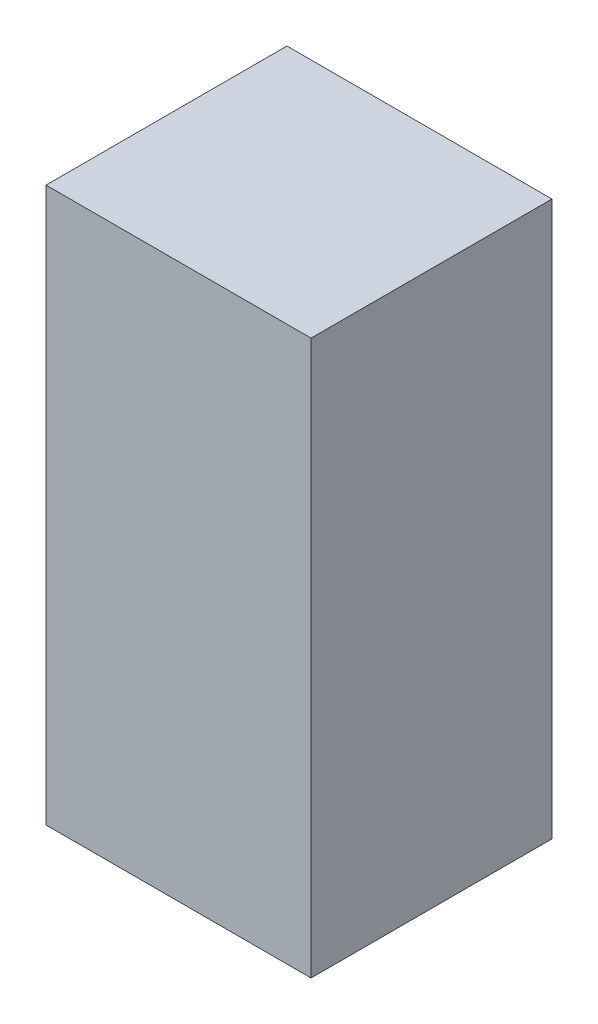
ISO-10303-21;
HEADER;
FILE_DESCRIPTION(('STEP AP214'),'2;1');
FILE_NAME('part.step','',(''),(''),'','','');
FILE_SCHEMA(('AUTOMOTIVE_DESIGN { 1 0 10303 214 1 1 1 1 }'));
ENDSEC;
DATA;
#1=APPLICATION_CONTEXT('core data for automotive mechanical design processes');
#2=APPLICATION_PROTOCOL_DEFINITION('international standard','automotive_design',2000,#1);
#3=PRODUCT_CONTEXT('',#1,'mechanical');
#4=PRODUCT('Part','Part','',(#3));
#5=PRODUCT_RELATED_PRODUCT_CATEGORY('part','',(#4));
#6=PRODUCT_DEFINITION_FORMATION('','',#4);
#7=PRODUCT_DEFINITION_CONTEXT('part definition',#1,'design');
#8=PRODUCT_DEFINITION('design','',#6,#7);
#9=PRODUCT_DEFINITION_SHAPE('','',#8);
#10=(LENGTH_UNIT() NAMED_UNIT(*) SI_UNIT(.MILLI.,.METRE.));
#11=(NAMED_UNIT(*) PLANE_ANGLE_UNIT() SI_UNIT($,.RADIAN.));
#12=(NAMED_UNIT(*) SI_UNIT($,.STERADIAN.) SOLID_ANGLE_UNIT());
#13=UNCERTAINTY_MEASURE_WITH_UNIT(LENGTH_MEASURE(1.E-05),#10,'distance_accuracy_value','');
#14=(GEOMETRIC_REPRESENTATION_CONTEXT(3) GLOBAL_UNCERTAINTY_ASSIGNED_CONTEXT((#13)) GLOBAL_UNIT_ASSIGNED_CONTEXT((#10,
#11,#12)) REPRESENTATION_CONTEXT('',''));
#15=CARTESIAN_POINT('',(0.,0.,0.));
#16=DIRECTION('',(0.,0.,1.));
#17=DIRECTION('',(1.,0.,0.));
#18=AXIS2_PLACEMENT_3D('',#15,#16,#17);
#19=CARTESIAN_POINT('',(-0.27499818,-0.57499758,0.499999));
#20=DIRECTION('',(0.,0.,-1.));
#21=DIRECTION('',(-1.,0.,0.));
#22=AXIS2_PLACEMENT_3D('',#19,#20,#21);
#23=PLANE('',#22);
#24=DIRECTION('',(0.,1.,0.));
#25=VECTOR('',#24,1.);
#26=CARTESIAN_POINT('',(0.27500072,-0.57499758,0.499999));
#27=LINE('',#26,#25);
#28=CARTESIAN_POINT('',(0.27500072,-0.57499758,0.499999));
#29=VERTEX_POINT('',#28);
#30=CARTESIAN_POINT('',(0.27500072,0.57500012,0.499999));
#31=VERTEX_POINT('',#30);
#32=EDGE_CURVE('E55',#29,#31,#27,.T.);
#33=ORIENTED_EDGE('',*,*,#32,.T.);
#34=DIRECTION('',(1.,0.,0.));
#35=VECTOR('',#34,1.);
#36=CARTESIAN_POINT('',(0.27500072,0.57500012,0.499999));
#37=LINE('',#36,#35);
#38=CARTESIAN_POINT('',(-0.27499818,0.57500012,0.499999));
#39=VERTEX_POINT('',#38);
#40=EDGE_CURVE('E57',#31,#39,#37,.F.);
#41=ORIENTED_EDGE('',*,*,#40,.T.);
#42=DIRECTION('',(0.,1.,0.));
#43=VECTOR('',#42,1.);
#44=CARTESIAN_POINT('',(-0.27499818,0.57500012,0.499999));
#45=LINE('',#44,#43);
#46=CARTESIAN_POINT('',(-0.27499818,-0.57499758,0.499999));
#47=VERTEX_POINT('',#46);
#48=EDGE_CURVE('E20',#39,#47,#45,.F.);
#49=ORIENTED_EDGE('',*,*,#48,.T.);
#50=DIRECTION('',(1.,0.,0.));
#51=VECTOR('',#50,1.);
#52=CARTESIAN_POINT('',(-0.27499818,-0.57499758,0.499999));
#53=LINE('',#52,#51);
#54=EDGE_CURVE('E80',#47,#29,#53,.T.);
#55=ORIENTED_EDGE('',*,*,#54,.T.);
#56=EDGE_LOOP('',(#33,#41,#49,#55));
#57=FACE_BOUND('',#56,.T.);
#58=ADVANCED_FACE('F17',(#57),#23,.F.);
#59=CARTESIAN_POINT('',(-0.27499818,0.57500012,0.));
#60=DIRECTION('',(1.,0.,0.));
#61=DIRECTION('',(0.,0.,-1.));
#62=AXIS2_PLACEMENT_3D('',#59,#60,#61);
#63=PLANE('',#62);
#64=DIRECTION('',(0.,0.,1.));
#65=VECTOR('',#64,1.);
#66=CARTESIAN_POINT('',(-0.27499818,-0.57499758,0.));
#67=LINE('',#66,#65);
#68=CARTESIAN_POINT('',(-0.27499818,-0.57499758,0.));
#69=VERTEX_POINT('',#68);
#70=EDGE_CURVE('E68',#69,#47,#67,.T.);
#71=ORIENTED_EDGE('',*,*,#70,.T.);
#72=ORIENTED_EDGE('',*,*,#48,.F.);
#73=DIRECTION('',(0.,0.,-1.));
#74=VECTOR('',#73,1.);
#75=CARTESIAN_POINT('',(-0.27499818,0.57500012,0.));
#76=LINE('',#75,#74);
#77=CARTESIAN_POINT('',(-0.27499818,0.57500012,0.));
#78=VERTEX_POINT('',#77);
#79=EDGE_CURVE('E63',#39,#78,#76,.T.);
#80=ORIENTED_EDGE('',*,*,#79,.T.);
#81=DIRECTION('',(0.,1.,0.));
#82=VECTOR('',#81,1.);
#83=CARTESIAN_POINT('',(-0.27499818,-0.57499758,0.));
#84=LINE('',#83,#82);
#85=EDGE_CURVE('E83',#69,#78,#84,.T.);
#86=ORIENTED_EDGE('',*,*,#85,.F.);
#87=EDGE_LOOP('',(#71,#72,#80,#86));
#88=FACE_BOUND('',#87,.T.);
#89=ADVANCED_FACE('F65',(#88),#63,.F.);
#90=CARTESIAN_POINT('',(0.27500072,0.57500012,0.));
#91=DIRECTION('',(0.,-1.,0.));
#92=DIRECTION('',(0.,0.,-1.));
#93=AXIS2_PLACEMENT_3D('',#90,#91,#92);
#94=PLANE('',#93);
#95=ORIENTED_EDGE('',*,*,#79,.F.);
#96=ORIENTED_EDGE('',*,*,#40,.F.);
#97=DIRECTION('',(0.,0.,1.));
#98=VECTOR('',#97,1.);
#99=CARTESIAN_POINT('',(0.27500072,0.57500012,0.));
#100=LINE('',#99,#98);
#101=CARTESIAN_POINT('',(0.27500072,0.57500012,0.));
#102=VERTEX_POINT('',#101);
#103=EDGE_CURVE('E75',#31,#102,#100,.F.);
#104=ORIENTED_EDGE('',*,*,#103,.T.);
#105=DIRECTION('',(-1.,0.,0.));
#106=VECTOR('',#105,1.);
#107=CARTESIAN_POINT('',(-0.27499818,0.57500012,0.));
#108=LINE('',#107,#106);
#109=EDGE_CURVE('E72',#78,#102,#108,.F.);
#110=ORIENTED_EDGE('',*,*,#109,.F.);
#111=EDGE_LOOP('',(#95,#96,#104,#110));
#112=FACE_BOUND('',#111,.T.);
#113=ADVANCED_FACE('F70',(#112),#94,.F.);
#114=CARTESIAN_POINT('',(0.27500072,-0.57499758,0.));
#115=DIRECTION('',(-1.,0.,0.));
#116=DIRECTION('',(0.,0.,1.));
#117=AXIS2_PLACEMENT_3D('',#114,#115,#116);
#118=PLANE('',#117);
#119=ORIENTED_EDGE('',*,*,#103,.F.);
#120=ORIENTED_EDGE('',*,*,#32,.F.);
#121=DIRECTION('',(0.,0.,1.));
#122=VECTOR('',#121,1.);
#123=CARTESIAN_POINT('',(0.27500072,-0.57499758,0.));
#124=LINE('',#123,#122);
#125=CARTESIAN_POINT('',(0.27500072,-0.57499758,0.));
#126=VERTEX_POINT('',#125);
#127=EDGE_CURVE('E35',#29,#126,#124,.F.);
#128=ORIENTED_EDGE('',*,*,#127,.T.);
#129=DIRECTION('',(0.,1.,0.));
#130=VECTOR('',#129,1.);
#131=CARTESIAN_POINT('',(0.27500072,-0.57499758,0.));
#132=LINE('',#131,#130);
#133=EDGE_CURVE('E26',#102,#126,#132,.F.);
#134=ORIENTED_EDGE('',*,*,#133,.F.);
#135=EDGE_LOOP('',(#119,#120,#128,#134));
#136=FACE_BOUND('',#135,.T.);
#137=ADVANCED_FACE('F89',(#136),#118,.F.);
#138=CARTESIAN_POINT('',(-0.27499818,-0.57499758,0.));
#139=DIRECTION('',(0.,1.,0.));
#140=DIRECTION('',(0.,0.,1.));
#141=AXIS2_PLACEMENT_3D('',#138,#139,#140);
#142=PLANE('',#141);
#143=ORIENTED_EDGE('',*,*,#127,.F.);
#144=ORIENTED_EDGE('',*,*,#54,.F.);
#145=ORIENTED_EDGE('',*,*,#70,.F.);
#146=DIRECTION('',(-1.,0.,0.));
#147=VECTOR('',#146,1.);
#148=CARTESIAN_POINT('',(-0.27499818,-0.57499758,0.));
#149=LINE('',#148,#147);
#150=EDGE_CURVE('E11',#126,#69,#149,.T.);
#151=ORIENTED_EDGE('',*,*,#150,.F.);
#152=EDGE_LOOP('',(#143,#144,#145,#151));
#153=FACE_BOUND('',#152,.T.);
#154=ADVANCED_FACE('F91',(#153),#142,.F.);
#155=CARTESIAN_POINT('',(-0.27499818,-0.57499758,0.));
#156=DIRECTION('',(0.,0.,-1.));
#157=DIRECTION('',(-1.,0.,0.));
#158=AXIS2_PLACEMENT_3D('',#155,#156,#157);
#159=PLANE('',#158);
#160=ORIENTED_EDGE('',*,*,#133,.T.);
#161=ORIENTED_EDGE('',*,*,#150,.T.);
#162=ORIENTED_EDGE('',*,*,#85,.T.);
#163=ORIENTED_EDGE('',*,*,#109,.T.);
#164=EDGE_LOOP('',(#160,#161,#162,#163));
#165=FACE_BOUND('',#164,.T.);
#166=ADVANCED_FACE('F88',(#165),#159,.T.);
#167=CLOSED_SHELL('',(#58,#89,#113,#137,#154,#166));
#168=MANIFOLD_SOLID_BREP('B1',#167);
#169=ADVANCED_BREP_SHAPE_REPRESENTATION('',(#18,#168),#14);
#170=SHAPE_DEFINITION_REPRESENTATION(#9,#169);
ENDSEC;
END-ISO-10303-21;
